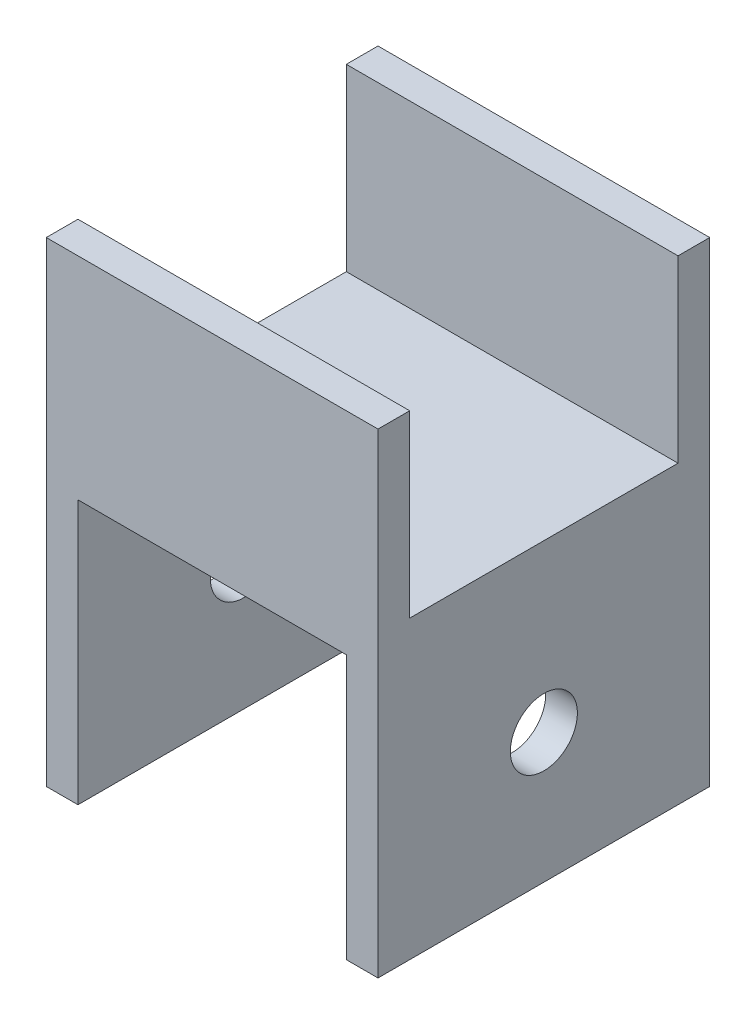
ISO-10303-21;
HEADER;
FILE_DESCRIPTION(('STEP AP214'),'2;1');
FILE_NAME('part.step','',(''),(''),'','','');
FILE_SCHEMA(('AUTOMOTIVE_DESIGN { 1 0 10303 214 1 1 1 1 }'));
ENDSEC;
DATA;
#1=APPLICATION_CONTEXT('core data for automotive mechanical design processes');
#2=APPLICATION_PROTOCOL_DEFINITION('international standard','automotive_design',2000,#1);
#3=PRODUCT_CONTEXT('',#1,'mechanical');
#4=PRODUCT('Part','Part','',(#3));
#5=PRODUCT_RELATED_PRODUCT_CATEGORY('part','',(#4));
#6=PRODUCT_DEFINITION_FORMATION('','',#4);
#7=PRODUCT_DEFINITION_CONTEXT('part definition',#1,'design');
#8=PRODUCT_DEFINITION('design','',#6,#7);
#9=PRODUCT_DEFINITION_SHAPE('','',#8);
#10=(LENGTH_UNIT() NAMED_UNIT(*) SI_UNIT(.MILLI.,.METRE.));
#11=(NAMED_UNIT(*) PLANE_ANGLE_UNIT() SI_UNIT($,.RADIAN.));
#12=(NAMED_UNIT(*) SI_UNIT($,.STERADIAN.) SOLID_ANGLE_UNIT());
#13=UNCERTAINTY_MEASURE_WITH_UNIT(LENGTH_MEASURE(1.E-05),#10,'distance_accuracy_value','');
#14=(GEOMETRIC_REPRESENTATION_CONTEXT(3) GLOBAL_UNCERTAINTY_ASSIGNED_CONTEXT((#13)) GLOBAL_UNIT_ASSIGNED_CONTEXT((#10,
#11,#12)) REPRESENTATION_CONTEXT('',''));
#15=CARTESIAN_POINT('',(0.,0.,0.));
#16=DIRECTION('',(0.,0.,1.));
#17=DIRECTION('',(1.,0.,0.));
#18=AXIS2_PLACEMENT_3D('',#15,#16,#17);
#19=CARTESIAN_POINT('',(31.4,0.,-31.4));
#20=DIRECTION('',(0.,1.,0.));
#21=DIRECTION('',(0.,0.,1.));
#22=AXIS2_PLACEMENT_3D('',#19,#20,#21);
#23=PLANE('',#22);
#24=DIRECTION('',(0.,0.,1.));
#25=VECTOR('',#24,1.);
#26=CARTESIAN_POINT('',(3.,0.,-31.4));
#27=LINE('',#26,#25);
#28=CARTESIAN_POINT('',(3.,0.,-31.4));
#29=VERTEX_POINT('',#28);
#30=CARTESIAN_POINT('',(3.,0.,0.));
#31=VERTEX_POINT('',#30);
#32=EDGE_CURVE('E48',#29,#31,#27,.T.);
#33=ORIENTED_EDGE('',*,*,#32,.F.);
#34=DIRECTION('',(-1.,0.,0.));
#35=VECTOR('',#34,1.);
#36=CARTESIAN_POINT('',(31.4,0.,-31.4));
#37=LINE('',#36,#35);
#38=CARTESIAN_POINT('',(28.4,0.,-31.4));
#39=VERTEX_POINT('',#38);
#40=EDGE_CURVE('E11',#39,#29,#37,.T.);
#41=ORIENTED_EDGE('',*,*,#40,.F.);
#42=DIRECTION('',(0.,0.,-1.));
#43=VECTOR('',#42,1.);
#44=CARTESIAN_POINT('',(28.4,0.,0.));
#45=LINE('',#44,#43);
#46=CARTESIAN_POINT('',(28.4,0.,0.));
#47=VERTEX_POINT('',#46);
#48=EDGE_CURVE('E157',#47,#39,#45,.T.);
#49=ORIENTED_EDGE('',*,*,#48,.F.);
#50=DIRECTION('',(-1.,0.,0.));
#51=VECTOR('',#50,1.);
#52=CARTESIAN_POINT('',(31.4,0.,0.));
#53=LINE('',#52,#51);
#54=EDGE_CURVE('E52',#47,#31,#53,.T.);
#55=ORIENTED_EDGE('',*,*,#54,.T.);
#56=EDGE_LOOP('',(#33,#41,#49,#55));
#57=FACE_BOUND('',#56,.T.);
#58=ADVANCED_FACE('F33',(#57),#23,.F.);
#59=CARTESIAN_POINT('',(31.4,20.,-31.4));
#60=DIRECTION('',(0.,0.,1.));
#61=DIRECTION('',(1.,0.,0.));
#62=AXIS2_PLACEMENT_3D('',#59,#60,#61);
#63=PLANE('',#62);
#64=DIRECTION('',(0.,1.,0.));
#65=VECTOR('',#64,1.);
#66=CARTESIAN_POINT('',(0.,20.,-31.4));
#67=LINE('',#66,#65);
#68=CARTESIAN_POINT('',(0.,-25.,-31.4));
#69=VERTEX_POINT('',#68);
#70=CARTESIAN_POINT('',(0.,20.,-31.4));
#71=VERTEX_POINT('',#70);
#72=EDGE_CURVE('E119',#69,#71,#67,.T.);
#73=ORIENTED_EDGE('',*,*,#72,.T.);
#74=DIRECTION('',(-1.,0.,0.));
#75=VECTOR('',#74,1.);
#76=CARTESIAN_POINT('',(31.4,20.,-31.4));
#77=LINE('',#76,#75);
#78=CARTESIAN_POINT('',(31.4,20.,-31.4));
#79=VERTEX_POINT('',#78);
#80=EDGE_CURVE('E41',#79,#71,#77,.T.);
#81=ORIENTED_EDGE('',*,*,#80,.F.);
#82=DIRECTION('',(0.,1.,0.));
#83=VECTOR('',#82,1.);
#84=CARTESIAN_POINT('',(31.4,20.,-31.4));
#85=LINE('',#84,#83);
#86=CARTESIAN_POINT('',(31.4,-25.,-31.4));
#87=VERTEX_POINT('',#86);
#88=EDGE_CURVE('E175',#87,#79,#85,.T.);
#89=ORIENTED_EDGE('',*,*,#88,.F.);
#90=DIRECTION('',(1.,0.,0.));
#91=VECTOR('',#90,1.);
#92=CARTESIAN_POINT('',(31.4,-25.,-31.4));
#93=LINE('',#92,#91);
#94=CARTESIAN_POINT('',(28.4,-25.,-31.4));
#95=VERTEX_POINT('',#94);
#96=EDGE_CURVE('E165',#95,#87,#93,.T.);
#97=ORIENTED_EDGE('',*,*,#96,.F.);
#98=DIRECTION('',(0.,1.,0.));
#99=VECTOR('',#98,1.);
#100=CARTESIAN_POINT('',(28.4,-25.,-31.4));
#101=LINE('',#100,#99);
#102=EDGE_CURVE('E168',#95,#39,#101,.T.);
#103=ORIENTED_EDGE('',*,*,#102,.T.);
#104=ORIENTED_EDGE('',*,*,#40,.T.);
#105=DIRECTION('',(0.,1.,0.));
#106=VECTOR('',#105,1.);
#107=CARTESIAN_POINT('',(3.,-25.,-31.4));
#108=LINE('',#107,#106);
#109=CARTESIAN_POINT('',(3.,-25.,-31.4));
#110=VERTEX_POINT('',#109);
#111=EDGE_CURVE('E136',#110,#29,#108,.T.);
#112=ORIENTED_EDGE('',*,*,#111,.F.);
#113=DIRECTION('',(1.,0.,0.));
#114=VECTOR('',#113,1.);
#115=CARTESIAN_POINT('',(0.,-25.,-31.4));
#116=LINE('',#115,#114);
#117=EDGE_CURVE('E133',#69,#110,#116,.T.);
#118=ORIENTED_EDGE('',*,*,#117,.F.);
#119=EDGE_LOOP('',(#73,#81,#89,#97,#103,#104,#112,#118));
#120=FACE_BOUND('',#119,.T.);
#121=ADVANCED_FACE('F134',(#120),#63,.F.);
#122=CARTESIAN_POINT('',(31.4,20.,-28.4));
#123=DIRECTION('',(0.,-1.,0.));
#124=DIRECTION('',(0.,0.,-1.));
#125=AXIS2_PLACEMENT_3D('',#122,#123,#124);
#126=PLANE('',#125);
#127=DIRECTION('',(0.,0.,1.));
#128=VECTOR('',#127,1.);
#129=CARTESIAN_POINT('',(0.,20.,-28.4));
#130=LINE('',#129,#128);
#131=CARTESIAN_POINT('',(0.,20.,-28.4));
#132=VERTEX_POINT('',#131);
#133=EDGE_CURVE('E126',#71,#132,#130,.T.);
#134=ORIENTED_EDGE('',*,*,#133,.T.);
#135=DIRECTION('',(-1.,0.,0.));
#136=VECTOR('',#135,1.);
#137=CARTESIAN_POINT('',(31.4,20.,-28.4));
#138=LINE('',#137,#136);
#139=CARTESIAN_POINT('',(31.4,20.,-28.4));
#140=VERTEX_POINT('',#139);
#141=EDGE_CURVE('E213',#140,#132,#138,.T.);
#142=ORIENTED_EDGE('',*,*,#141,.F.);
#143=DIRECTION('',(0.,0.,1.));
#144=VECTOR('',#143,1.);
#145=CARTESIAN_POINT('',(31.4,20.,-28.4));
#146=LINE('',#145,#144);
#147=EDGE_CURVE('E177',#79,#140,#146,.T.);
#148=ORIENTED_EDGE('',*,*,#147,.F.);
#149=ORIENTED_EDGE('',*,*,#80,.T.);
#150=EDGE_LOOP('',(#134,#142,#148,#149));
#151=FACE_BOUND('',#150,.T.);
#152=ADVANCED_FACE('F218',(#151),#126,.F.);
#153=CARTESIAN_POINT('',(31.4,20.,-28.4));
#154=DIRECTION('',(0.,0.,-1.));
#155=DIRECTION('',(-1.,0.,0.));
#156=AXIS2_PLACEMENT_3D('',#153,#154,#155);
#157=PLANE('',#156);
#158=DIRECTION('',(0.,-1.,0.));
#159=VECTOR('',#158,1.);
#160=CARTESIAN_POINT('',(0.,20.,-28.4));
#161=LINE('',#160,#159);
#162=CARTESIAN_POINT('',(0.,3.,-28.4));
#163=VERTEX_POINT('',#162);
#164=EDGE_CURVE('E191',#132,#163,#161,.T.);
#165=ORIENTED_EDGE('',*,*,#164,.T.);
#166=DIRECTION('',(-1.,0.,0.));
#167=VECTOR('',#166,1.);
#168=CARTESIAN_POINT('',(31.4,3.,-28.4));
#169=LINE('',#168,#167);
#170=CARTESIAN_POINT('',(31.4,3.,-28.4));
#171=VERTEX_POINT('',#170);
#172=EDGE_CURVE('E210',#171,#163,#169,.T.);
#173=ORIENTED_EDGE('',*,*,#172,.F.);
#174=DIRECTION('',(0.,-1.,0.));
#175=VECTOR('',#174,1.);
#176=CARTESIAN_POINT('',(31.4,20.,-28.4));
#177=LINE('',#176,#175);
#178=EDGE_CURVE('E180',#140,#171,#177,.T.);
#179=ORIENTED_EDGE('',*,*,#178,.F.);
#180=ORIENTED_EDGE('',*,*,#141,.T.);
#181=EDGE_LOOP('',(#165,#173,#179,#180));
#182=FACE_BOUND('',#181,.T.);
#183=ADVANCED_FACE('F255',(#182),#157,.F.);
#184=CARTESIAN_POINT('',(31.4,3.,-28.4));
#185=DIRECTION('',(0.,-1.,0.));
#186=DIRECTION('',(0.,0.,-1.));
#187=AXIS2_PLACEMENT_3D('',#184,#185,#186);
#188=PLANE('',#187);
#189=DIRECTION('',(0.,0.,1.));
#190=VECTOR('',#189,1.);
#191=CARTESIAN_POINT('',(0.,3.,-28.4));
#192=LINE('',#191,#190);
#193=CARTESIAN_POINT('',(0.,3.,-3.));
#194=VERTEX_POINT('',#193);
#195=EDGE_CURVE('E193',#163,#194,#192,.T.);
#196=ORIENTED_EDGE('',*,*,#195,.T.);
#197=DIRECTION('',(-1.,0.,0.));
#198=VECTOR('',#197,1.);
#199=CARTESIAN_POINT('',(31.4,3.,-3.));
#200=LINE('',#199,#198);
#201=CARTESIAN_POINT('',(31.4,3.,-3.));
#202=VERTEX_POINT('',#201);
#203=EDGE_CURVE('E207',#202,#194,#200,.T.);
#204=ORIENTED_EDGE('',*,*,#203,.F.);
#205=DIRECTION('',(0.,0.,1.));
#206=VECTOR('',#205,1.);
#207=CARTESIAN_POINT('',(31.4,3.,-28.4));
#208=LINE('',#207,#206);
#209=EDGE_CURVE('E182',#171,#202,#208,.T.);
#210=ORIENTED_EDGE('',*,*,#209,.F.);
#211=ORIENTED_EDGE('',*,*,#172,.T.);
#212=EDGE_LOOP('',(#196,#204,#210,#211));
#213=FACE_BOUND('',#212,.T.);
#214=ADVANCED_FACE('F252',(#213),#188,.F.);
#215=CARTESIAN_POINT('',(31.4,3.,-3.));
#216=DIRECTION('',(0.,0.,1.));
#217=DIRECTION('',(1.,0.,0.));
#218=AXIS2_PLACEMENT_3D('',#215,#216,#217);
#219=PLANE('',#218);
#220=DIRECTION('',(0.,1.,0.));
#221=VECTOR('',#220,1.);
#222=CARTESIAN_POINT('',(0.,3.,-3.));
#223=LINE('',#222,#221);
#224=CARTESIAN_POINT('',(0.,20.,-3.));
#225=VERTEX_POINT('',#224);
#226=EDGE_CURVE('E195',#194,#225,#223,.T.);
#227=ORIENTED_EDGE('',*,*,#226,.T.);
#228=DIRECTION('',(-1.,0.,0.));
#229=VECTOR('',#228,1.);
#230=CARTESIAN_POINT('',(31.4,20.,-3.));
#231=LINE('',#230,#229);
#232=CARTESIAN_POINT('',(31.4,20.,-3.));
#233=VERTEX_POINT('',#232);
#234=EDGE_CURVE('E204',#233,#225,#231,.T.);
#235=ORIENTED_EDGE('',*,*,#234,.F.);
#236=DIRECTION('',(0.,1.,0.));
#237=VECTOR('',#236,1.);
#238=CARTESIAN_POINT('',(31.4,3.,-3.));
#239=LINE('',#238,#237);
#240=EDGE_CURVE('E184',#202,#233,#239,.T.);
#241=ORIENTED_EDGE('',*,*,#240,.F.);
#242=ORIENTED_EDGE('',*,*,#203,.T.);
#243=EDGE_LOOP('',(#227,#235,#241,#242));
#244=FACE_BOUND('',#243,.T.);
#245=ADVANCED_FACE('F248',(#244),#219,.F.);
#246=CARTESIAN_POINT('',(31.4,20.,0.));
#247=DIRECTION('',(0.,-1.,0.));
#248=DIRECTION('',(0.,0.,-1.));
#249=AXIS2_PLACEMENT_3D('',#246,#247,#248);
#250=PLANE('',#249);
#251=DIRECTION('',(0.,0.,1.));
#252=VECTOR('',#251,1.);
#253=CARTESIAN_POINT('',(0.,20.,0.));
#254=LINE('',#253,#252);
#255=CARTESIAN_POINT('',(0.,20.,0.));
#256=VERTEX_POINT('',#255);
#257=EDGE_CURVE('E197',#225,#256,#254,.T.);
#258=ORIENTED_EDGE('',*,*,#257,.T.);
#259=DIRECTION('',(-1.,0.,0.));
#260=VECTOR('',#259,1.);
#261=CARTESIAN_POINT('',(31.4,20.,0.));
#262=LINE('',#261,#260);
#263=CARTESIAN_POINT('',(31.4,20.,0.));
#264=VERTEX_POINT('',#263);
#265=EDGE_CURVE('E201',#264,#256,#262,.T.);
#266=ORIENTED_EDGE('',*,*,#265,.F.);
#267=DIRECTION('',(0.,0.,1.));
#268=VECTOR('',#267,1.);
#269=CARTESIAN_POINT('',(31.4,20.,0.));
#270=LINE('',#269,#268);
#271=EDGE_CURVE('E186',#233,#264,#270,.T.);
#272=ORIENTED_EDGE('',*,*,#271,.F.);
#273=ORIENTED_EDGE('',*,*,#234,.T.);
#274=EDGE_LOOP('',(#258,#266,#272,#273));
#275=FACE_BOUND('',#274,.T.);
#276=ADVANCED_FACE('F244',(#275),#250,.F.);
#277=CARTESIAN_POINT('',(31.4,0.,0.));
#278=DIRECTION('',(0.,0.,-1.));
#279=DIRECTION('',(0.,1.,0.));
#280=AXIS2_PLACEMENT_3D('',#277,#278,#279);
#281=PLANE('',#280);
#282=DIRECTION('',(0.,-1.,0.));
#283=VECTOR('',#282,1.);
#284=CARTESIAN_POINT('',(0.,0.,0.));
#285=LINE('',#284,#283);
#286=CARTESIAN_POINT('',(0.,-25.,0.));
#287=VERTEX_POINT('',#286);
#288=EDGE_CURVE('E178',#256,#287,#285,.T.);
#289=ORIENTED_EDGE('',*,*,#288,.T.);
#290=DIRECTION('',(-1.,0.,0.));
#291=VECTOR('',#290,1.);
#292=CARTESIAN_POINT('',(0.,-25.,0.));
#293=LINE('',#292,#291);
#294=CARTESIAN_POINT('',(3.,-25.,0.));
#295=VERTEX_POINT('',#294);
#296=EDGE_CURVE('E144',#295,#287,#293,.T.);
#297=ORIENTED_EDGE('',*,*,#296,.F.);
#298=DIRECTION('',(0.,1.,0.));
#299=VECTOR('',#298,1.);
#300=CARTESIAN_POINT('',(3.,-25.,0.));
#301=LINE('',#300,#299);
#302=EDGE_CURVE('E152',#295,#31,#301,.T.);
#303=ORIENTED_EDGE('',*,*,#302,.T.);
#304=ORIENTED_EDGE('',*,*,#54,.F.);
#305=DIRECTION('',(0.,1.,0.));
#306=VECTOR('',#305,1.);
#307=CARTESIAN_POINT('',(28.4,-25.,0.));
#308=LINE('',#307,#306);
#309=CARTESIAN_POINT('',(28.4,-25.,0.));
#310=VERTEX_POINT('',#309);
#311=EDGE_CURVE('E130',#310,#47,#308,.T.);
#312=ORIENTED_EDGE('',*,*,#311,.F.);
#313=DIRECTION('',(-1.,0.,0.));
#314=VECTOR('',#313,1.);
#315=CARTESIAN_POINT('',(31.4,-25.,0.));
#316=LINE('',#315,#314);
#317=CARTESIAN_POINT('',(31.4,-25.,0.));
#318=VERTEX_POINT('',#317);
#319=EDGE_CURVE('E161',#318,#310,#316,.T.);
#320=ORIENTED_EDGE('',*,*,#319,.F.);
#321=DIRECTION('',(0.,-1.,0.));
#322=VECTOR('',#321,1.);
#323=CARTESIAN_POINT('',(31.4,0.,0.));
#324=LINE('',#323,#322);
#325=EDGE_CURVE('E188',#264,#318,#324,.T.);
#326=ORIENTED_EDGE('',*,*,#325,.F.);
#327=ORIENTED_EDGE('',*,*,#265,.T.);
#328=EDGE_LOOP('',(#289,#297,#303,#304,#312,#320,#326,#327));
#329=FACE_BOUND('',#328,.T.);
#330=ADVANCED_FACE('F234',(#329),#281,.F.);
#331=CARTESIAN_POINT('',(31.4,0.,0.));
#332=DIRECTION('',(-1.,0.,0.));
#333=DIRECTION('',(0.,0.,1.));
#334=AXIS2_PLACEMENT_3D('',#331,#332,#333);
#335=PLANE('',#334);
#336=CARTESIAN_POINT('',(31.4,-12.7,-15.7));
#337=DIRECTION('',(1.,0.,0.));
#338=DIRECTION('',(0.,0.,-1.));
#339=AXIS2_PLACEMENT_3D('',#336,#337,#338);
#340=CIRCLE('',#339,3.175);
#341=CARTESIAN_POINT('',(31.4,-12.7,-18.875));
#342=VERTEX_POINT('',#341);
#343=EDGE_CURVE('E411',#342,#342,#340,.T.);
#344=ORIENTED_EDGE('',*,*,#343,.F.);
#345=EDGE_LOOP('',(#344));
#346=FACE_BOUND('',#345,.T.);
#347=ORIENTED_EDGE('',*,*,#325,.T.);
#348=DIRECTION('',(0.,0.,1.));
#349=VECTOR('',#348,1.);
#350=CARTESIAN_POINT('',(31.4,-25.,0.));
#351=LINE('',#350,#349);
#352=EDGE_CURVE('E158',#87,#318,#351,.T.);
#353=ORIENTED_EDGE('',*,*,#352,.F.);
#354=ORIENTED_EDGE('',*,*,#88,.T.);
#355=ORIENTED_EDGE('',*,*,#147,.T.);
#356=ORIENTED_EDGE('',*,*,#178,.T.);
#357=ORIENTED_EDGE('',*,*,#209,.T.);
#358=ORIENTED_EDGE('',*,*,#240,.T.);
#359=ORIENTED_EDGE('',*,*,#271,.T.);
#360=EDGE_LOOP('',(#347,#353,#354,#355,#356,#357,#358,#359));
#361=FACE_BOUND('',#360,.T.);
#362=ADVANCED_FACE('F227',(#346,#361),#335,.F.);
#363=CARTESIAN_POINT('',(0.,0.,0.));
#364=DIRECTION('',(-1.,0.,0.));
#365=DIRECTION('',(0.,0.,1.));
#366=AXIS2_PLACEMENT_3D('',#363,#364,#365);
#367=PLANE('',#366);
#368=CARTESIAN_POINT('',(0.,-12.7,-15.7));
#369=DIRECTION('',(1.,0.,0.));
#370=DIRECTION('',(0.,0.,-1.));
#371=AXIS2_PLACEMENT_3D('',#368,#369,#370);
#372=CIRCLE('',#371,3.17499999999999);
#373=CARTESIAN_POINT('',(0.,-12.7,-18.875));
#374=VERTEX_POINT('',#373);
#375=EDGE_CURVE('E415',#374,#374,#372,.T.);
#376=ORIENTED_EDGE('',*,*,#375,.T.);
#377=EDGE_LOOP('',(#376));
#378=FACE_BOUND('',#377,.T.);
#379=ORIENTED_EDGE('',*,*,#72,.F.);
#380=DIRECTION('',(0.,0.,-1.));
#381=VECTOR('',#380,1.);
#382=CARTESIAN_POINT('',(0.,-25.,-31.4));
#383=LINE('',#382,#381);
#384=EDGE_CURVE('E124',#287,#69,#383,.T.);
#385=ORIENTED_EDGE('',*,*,#384,.F.);
#386=ORIENTED_EDGE('',*,*,#288,.F.);
#387=ORIENTED_EDGE('',*,*,#257,.F.);
#388=ORIENTED_EDGE('',*,*,#226,.F.);
#389=ORIENTED_EDGE('',*,*,#195,.F.);
#390=ORIENTED_EDGE('',*,*,#164,.F.);
#391=ORIENTED_EDGE('',*,*,#133,.F.);
#392=EDGE_LOOP('',(#379,#385,#386,#387,#388,#389,#390,#391));
#393=FACE_BOUND('',#392,.T.);
#394=ADVANCED_FACE('F121',(#378,#393),#367,.T.);
#395=CARTESIAN_POINT('',(28.4,-25.,0.));
#396=DIRECTION('',(1.,0.,0.));
#397=DIRECTION('',(0.,0.,-1.));
#398=AXIS2_PLACEMENT_3D('',#395,#396,#397);
#399=PLANE('',#398);
#400=CARTESIAN_POINT('',(28.4,-12.7,-15.7));
#401=DIRECTION('',(1.,0.,0.));
#402=DIRECTION('',(0.,0.,-1.));
#403=AXIS2_PLACEMENT_3D('',#400,#401,#402);
#404=CIRCLE('',#403,3.175);
#405=CARTESIAN_POINT('',(28.4,-12.7,-18.875));
#406=VERTEX_POINT('',#405);
#407=EDGE_CURVE('E146',#406,#406,#404,.T.);
#408=ORIENTED_EDGE('',*,*,#407,.T.);
#409=EDGE_LOOP('',(#408));
#410=FACE_BOUND('',#409,.T.);
#411=ORIENTED_EDGE('',*,*,#48,.T.);
#412=ORIENTED_EDGE('',*,*,#102,.F.);
#413=DIRECTION('',(0.,0.,-1.));
#414=VECTOR('',#413,1.);
#415=CARTESIAN_POINT('',(28.4,-25.,0.));
#416=LINE('',#415,#414);
#417=EDGE_CURVE('E163',#310,#95,#416,.T.);
#418=ORIENTED_EDGE('',*,*,#417,.F.);
#419=ORIENTED_EDGE('',*,*,#311,.T.);
#420=EDGE_LOOP('',(#411,#412,#418,#419));
#421=FACE_BOUND('',#420,.T.);
#422=ADVANCED_FACE('F236',(#410,#421),#399,.F.);
#423=CARTESIAN_POINT('',(0.,-25.,0.));
#424=DIRECTION('',(0.,1.,0.));
#425=DIRECTION('',(0.,0.,1.));
#426=AXIS2_PLACEMENT_3D('',#423,#424,#425);
#427=PLANE('',#426);
#428=ORIENTED_EDGE('',*,*,#352,.T.);
#429=ORIENTED_EDGE('',*,*,#319,.T.);
#430=ORIENTED_EDGE('',*,*,#417,.T.);
#431=ORIENTED_EDGE('',*,*,#96,.T.);
#432=EDGE_LOOP('',(#428,#429,#430,#431));
#433=FACE_BOUND('',#432,.T.);
#434=ADVANCED_FACE('F224',(#433),#427,.F.);
#435=CARTESIAN_POINT('',(3.,-25.,-31.4));
#436=DIRECTION('',(-1.,0.,0.));
#437=DIRECTION('',(0.,0.,1.));
#438=AXIS2_PLACEMENT_3D('',#435,#436,#437);
#439=PLANE('',#438);
#440=CARTESIAN_POINT('',(3.,-12.7,-15.7));
#441=DIRECTION('',(-1.,0.,0.));
#442=DIRECTION('',(0.,0.,1.));
#443=AXIS2_PLACEMENT_3D('',#440,#441,#442);
#444=CIRCLE('',#443,3.175);
#445=CARTESIAN_POINT('',(3.,-12.7,-12.525));
#446=VERTEX_POINT('',#445);
#447=EDGE_CURVE('E36',#446,#446,#444,.T.);
#448=ORIENTED_EDGE('',*,*,#447,.T.);
#449=EDGE_LOOP('',(#448));
#450=FACE_BOUND('',#449,.T.);
#451=ORIENTED_EDGE('',*,*,#32,.T.);
#452=ORIENTED_EDGE('',*,*,#302,.F.);
#453=DIRECTION('',(0.,0.,1.));
#454=VECTOR('',#453,1.);
#455=CARTESIAN_POINT('',(3.,-25.,-31.4));
#456=LINE('',#455,#454);
#457=EDGE_CURVE('E139',#110,#295,#456,.T.);
#458=ORIENTED_EDGE('',*,*,#457,.F.);
#459=ORIENTED_EDGE('',*,*,#111,.T.);
#460=EDGE_LOOP('',(#451,#452,#458,#459));
#461=FACE_BOUND('',#460,.T.);
#462=ADVANCED_FACE('F238',(#450,#461),#439,.F.);
#463=CARTESIAN_POINT('',(0.,-25.,0.));
#464=DIRECTION('',(0.,1.,0.));
#465=DIRECTION('',(0.,0.,1.));
#466=AXIS2_PLACEMENT_3D('',#463,#464,#465);
#467=PLANE('',#466);
#468=ORIENTED_EDGE('',*,*,#384,.T.);
#469=ORIENTED_EDGE('',*,*,#117,.T.);
#470=ORIENTED_EDGE('',*,*,#457,.T.);
#471=ORIENTED_EDGE('',*,*,#296,.T.);
#472=EDGE_LOOP('',(#468,#469,#470,#471));
#473=FACE_BOUND('',#472,.T.);
#474=ADVANCED_FACE('F142',(#473),#467,.F.);
#475=CARTESIAN_POINT('',(31.4,-12.7,-15.7));
#476=DIRECTION('',(1.,0.,0.));
#477=DIRECTION('',(0.,0.,-1.));
#478=AXIS2_PLACEMENT_3D('',#475,#476,#477);
#479=CYLINDRICAL_SURFACE('',#478,3.175);
#480=ORIENTED_EDGE('',*,*,#375,.F.);
#481=EDGE_LOOP('',(#480));
#482=FACE_BOUND('',#481,.T.);
#483=ORIENTED_EDGE('',*,*,#447,.F.);
#484=EDGE_LOOP('',(#483));
#485=FACE_BOUND('',#484,.T.);
#486=ADVANCED_FACE('F382',(#482,#485),#479,.F.);
#487=ORIENTED_EDGE('',*,*,#343,.T.);
#488=EDGE_LOOP('',(#487));
#489=FACE_BOUND('',#488,.T.);
#490=ORIENTED_EDGE('',*,*,#407,.F.);
#491=EDGE_LOOP('',(#490));
#492=FACE_BOUND('',#491,.T.);
#493=ADVANCED_FACE('F389',(#489,#492),#479,.F.);
#494=CLOSED_SHELL('',(#58,#121,#152,#183,#214,#245,#276,#330,#362,#394,#422,#434,#462,#474,#486,#493));
#495=MANIFOLD_SOLID_BREP('B2',#494);
#496=ADVANCED_BREP_SHAPE_REPRESENTATION('',(#18,#495),#14);
#497=SHAPE_DEFINITION_REPRESENTATION(#9,#496);
ENDSEC;
END-ISO-10303-21;
